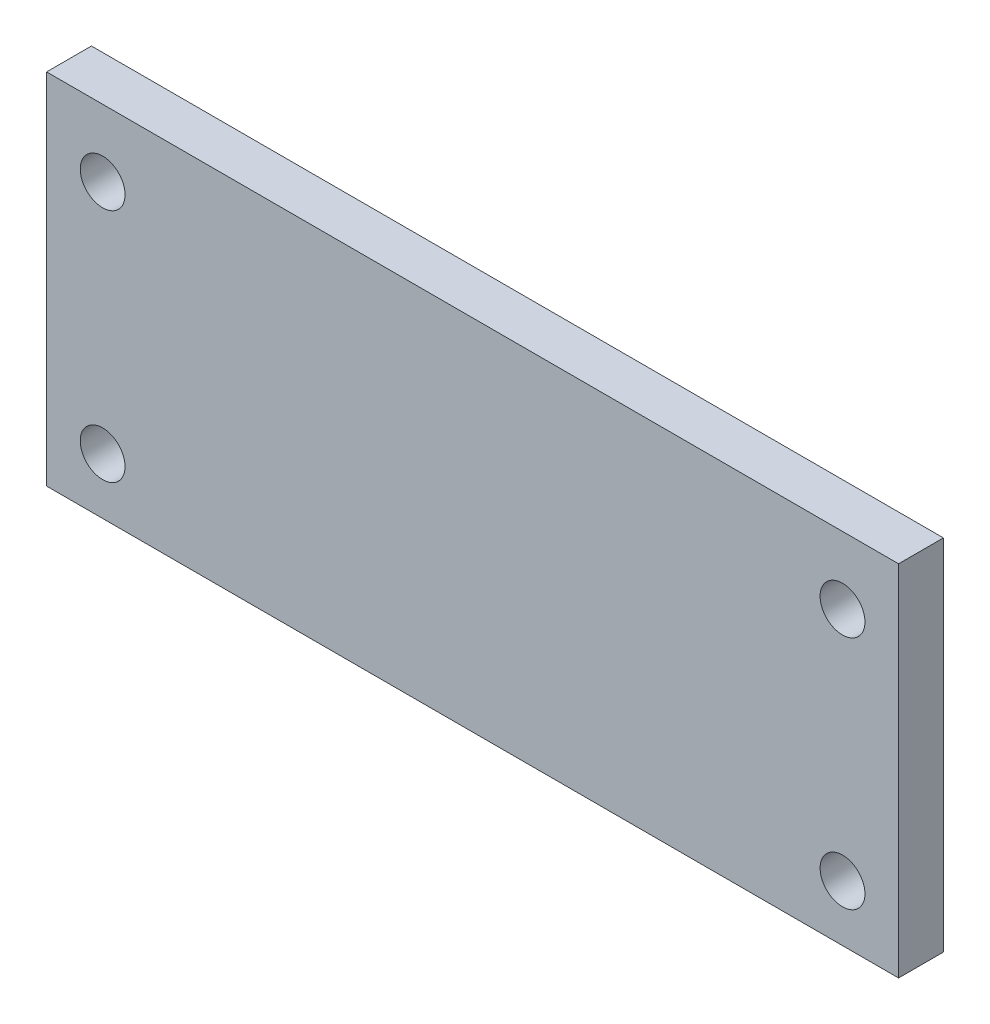
ISO-10303-21;
HEADER;
FILE_DESCRIPTION(('STEP AP214'),'2;1');
FILE_NAME('part.step','',(''),(''),'','','');
FILE_SCHEMA(('AUTOMOTIVE_DESIGN { 1 0 10303 214 1 1 1 1 }'));
ENDSEC;
DATA;
#1=APPLICATION_CONTEXT('core data for automotive mechanical design processes');
#2=APPLICATION_PROTOCOL_DEFINITION('international standard','automotive_design',2000,#1);
#3=PRODUCT_CONTEXT('',#1,'mechanical');
#4=PRODUCT('Part','Part','',(#3));
#5=PRODUCT_RELATED_PRODUCT_CATEGORY('part','',(#4));
#6=PRODUCT_DEFINITION_FORMATION('','',#4);
#7=PRODUCT_DEFINITION_CONTEXT('part definition',#1,'design');
#8=PRODUCT_DEFINITION('design','',#6,#7);
#9=PRODUCT_DEFINITION_SHAPE('','',#8);
#10=(LENGTH_UNIT() NAMED_UNIT(*) SI_UNIT(.MILLI.,.METRE.));
#11=(NAMED_UNIT(*) PLANE_ANGLE_UNIT() SI_UNIT($,.RADIAN.));
#12=(NAMED_UNIT(*) SI_UNIT($,.STERADIAN.) SOLID_ANGLE_UNIT());
#13=UNCERTAINTY_MEASURE_WITH_UNIT(LENGTH_MEASURE(1.E-05),#10,'distance_accuracy_value','');
#14=(GEOMETRIC_REPRESENTATION_CONTEXT(3) GLOBAL_UNCERTAINTY_ASSIGNED_CONTEXT((#13)) GLOBAL_UNIT_ASSIGNED_CONTEXT((#10,
#11,#12)) REPRESENTATION_CONTEXT('',''));
#15=CARTESIAN_POINT('',(0.,0.,0.));
#16=DIRECTION('',(0.,0.,1.));
#17=DIRECTION('',(1.,0.,0.));
#18=AXIS2_PLACEMENT_3D('',#15,#16,#17);
#19=CARTESIAN_POINT('',(0.,0.,4.));
#20=DIRECTION('',(0.,0.,-1.));
#21=DIRECTION('',(-1.,0.,0.));
#22=AXIS2_PLACEMENT_3D('',#19,#20,#21);
#23=PLANE('',#22);
#24=DIRECTION('',(0.,-1.,0.));
#25=VECTOR('',#24,1.);
#26=CARTESIAN_POINT('',(0.,0.,4.));
#27=LINE('',#26,#25);
#28=CARTESIAN_POINT('',(0.,32.,4.));
#29=VERTEX_POINT('',#28);
#30=CARTESIAN_POINT('',(0.,0.,4.));
#31=VERTEX_POINT('',#30);
#32=EDGE_CURVE('E89',#29,#31,#27,.T.);
#33=ORIENTED_EDGE('',*,*,#32,.T.);
#34=DIRECTION('',(1.,0.,0.));
#35=VECTOR('',#34,1.);
#36=CARTESIAN_POINT('',(0.,0.,4.));
#37=LINE('',#36,#35);
#38=CARTESIAN_POINT('',(76.,0.,4.));
#39=VERTEX_POINT('',#38);
#40=EDGE_CURVE('E84',#31,#39,#37,.T.);
#41=ORIENTED_EDGE('',*,*,#40,.T.);
#42=DIRECTION('',(0.,1.,0.));
#43=VECTOR('',#42,1.);
#44=CARTESIAN_POINT('',(76.,0.,4.));
#45=LINE('',#44,#43);
#46=CARTESIAN_POINT('',(76.,32.,4.));
#47=VERTEX_POINT('',#46);
#48=EDGE_CURVE('E87',#39,#47,#45,.T.);
#49=ORIENTED_EDGE('',*,*,#48,.T.);
#50=DIRECTION('',(-1.,0.,0.));
#51=VECTOR('',#50,1.);
#52=CARTESIAN_POINT('',(0.,32.,4.));
#53=LINE('',#52,#51);
#54=EDGE_CURVE('E54',#47,#29,#53,.T.);
#55=ORIENTED_EDGE('',*,*,#54,.T.);
#56=EDGE_LOOP('',(#33,#41,#49,#55));
#57=FACE_BOUND('',#56,.T.);
#58=CARTESIAN_POINT('',(5.,5.,4.));
#59=DIRECTION('',(0.,0.,1.));
#60=DIRECTION('',(1.,0.,0.));
#61=AXIS2_PLACEMENT_3D('',#58,#59,#60);
#62=CIRCLE('',#61,2.);
#63=CARTESIAN_POINT('',(7.,5.,4.));
#64=VERTEX_POINT('',#63);
#65=EDGE_CURVE('E104',#64,#64,#62,.T.);
#66=ORIENTED_EDGE('',*,*,#65,.F.);
#67=EDGE_LOOP('',(#66));
#68=FACE_BOUND('',#67,.T.);
#69=CARTESIAN_POINT('',(5.,26.,4.));
#70=DIRECTION('',(0.,0.,1.));
#71=DIRECTION('',(1.,0.,0.));
#72=AXIS2_PLACEMENT_3D('',#69,#70,#71);
#73=CIRCLE('',#72,2.);
#74=CARTESIAN_POINT('',(7.,26.,4.));
#75=VERTEX_POINT('',#74);
#76=EDGE_CURVE('E119',#75,#75,#73,.T.);
#77=ORIENTED_EDGE('',*,*,#76,.F.);
#78=EDGE_LOOP('',(#77));
#79=FACE_BOUND('',#78,.T.);
#80=CARTESIAN_POINT('',(71.,26.,4.));
#81=DIRECTION('',(0.,0.,1.));
#82=DIRECTION('',(1.,0.,0.));
#83=AXIS2_PLACEMENT_3D('',#80,#81,#82);
#84=CIRCLE('',#83,2.);
#85=CARTESIAN_POINT('',(73.,26.,4.));
#86=VERTEX_POINT('',#85);
#87=EDGE_CURVE('E125',#86,#86,#84,.T.);
#88=ORIENTED_EDGE('',*,*,#87,.F.);
#89=EDGE_LOOP('',(#88));
#90=FACE_BOUND('',#89,.T.);
#91=CARTESIAN_POINT('',(71.,5.,4.));
#92=DIRECTION('',(0.,0.,1.));
#93=DIRECTION('',(1.,0.,0.));
#94=AXIS2_PLACEMENT_3D('',#91,#92,#93);
#95=CIRCLE('',#94,2.);
#96=CARTESIAN_POINT('',(73.,5.,4.));
#97=VERTEX_POINT('',#96);
#98=EDGE_CURVE('E131',#97,#97,#95,.T.);
#99=ORIENTED_EDGE('',*,*,#98,.F.);
#100=EDGE_LOOP('',(#99));
#101=FACE_BOUND('',#100,.T.);
#102=ADVANCED_FACE('F37',(#57,#68,#79,#90,#101),#23,.F.);
#103=CARTESIAN_POINT('',(0.,0.,0.));
#104=DIRECTION('',(0.,0.,-1.));
#105=DIRECTION('',(-1.,0.,0.));
#106=AXIS2_PLACEMENT_3D('',#103,#104,#105);
#107=PLANE('',#106);
#108=CARTESIAN_POINT('',(71.,26.,0.));
#109=DIRECTION('',(0.,0.,1.));
#110=DIRECTION('',(1.,0.,0.));
#111=AXIS2_PLACEMENT_3D('',#108,#109,#110);
#112=CIRCLE('',#111,2.);
#113=CARTESIAN_POINT('',(73.,26.,0.));
#114=VERTEX_POINT('',#113);
#115=EDGE_CURVE('E128',#114,#114,#112,.T.);
#116=ORIENTED_EDGE('',*,*,#115,.T.);
#117=EDGE_LOOP('',(#116));
#118=FACE_BOUND('',#117,.T.);
#119=CARTESIAN_POINT('',(5.,5.,0.));
#120=DIRECTION('',(0.,0.,1.));
#121=DIRECTION('',(1.,0.,0.));
#122=AXIS2_PLACEMENT_3D('',#119,#120,#121);
#123=CIRCLE('',#122,2.);
#124=CARTESIAN_POINT('',(7.,5.,0.));
#125=VERTEX_POINT('',#124);
#126=EDGE_CURVE('E116',#125,#125,#123,.T.);
#127=ORIENTED_EDGE('',*,*,#126,.T.);
#128=EDGE_LOOP('',(#127));
#129=FACE_BOUND('',#128,.T.);
#130=DIRECTION('',(0.,-1.,0.));
#131=VECTOR('',#130,1.);
#132=CARTESIAN_POINT('',(0.,0.,0.));
#133=LINE('',#132,#131);
#134=CARTESIAN_POINT('',(0.,32.,0.));
#135=VERTEX_POINT('',#134);
#136=CARTESIAN_POINT('',(0.,0.,0.));
#137=VERTEX_POINT('',#136);
#138=EDGE_CURVE('E101',#135,#137,#133,.T.);
#139=ORIENTED_EDGE('',*,*,#138,.F.);
#140=DIRECTION('',(-1.,0.,0.));
#141=VECTOR('',#140,1.);
#142=CARTESIAN_POINT('',(0.,32.,0.));
#143=LINE('',#142,#141);
#144=CARTESIAN_POINT('',(76.,32.,0.));
#145=VERTEX_POINT('',#144);
#146=EDGE_CURVE('E77',#145,#135,#143,.T.);
#147=ORIENTED_EDGE('',*,*,#146,.F.);
#148=DIRECTION('',(0.,1.,0.));
#149=VECTOR('',#148,1.);
#150=CARTESIAN_POINT('',(76.,0.,0.));
#151=LINE('',#150,#149);
#152=CARTESIAN_POINT('',(76.,0.,0.));
#153=VERTEX_POINT('',#152);
#154=EDGE_CURVE('E71',#153,#145,#151,.T.);
#155=ORIENTED_EDGE('',*,*,#154,.F.);
#156=DIRECTION('',(1.,0.,0.));
#157=VECTOR('',#156,1.);
#158=CARTESIAN_POINT('',(0.,0.,0.));
#159=LINE('',#158,#157);
#160=EDGE_CURVE('E93',#137,#153,#159,.T.);
#161=ORIENTED_EDGE('',*,*,#160,.F.);
#162=EDGE_LOOP('',(#139,#147,#155,#161));
#163=FACE_BOUND('',#162,.T.);
#164=CARTESIAN_POINT('',(5.,26.,0.));
#165=DIRECTION('',(0.,0.,1.));
#166=DIRECTION('',(1.,0.,0.));
#167=AXIS2_PLACEMENT_3D('',#164,#165,#166);
#168=CIRCLE('',#167,2.);
#169=CARTESIAN_POINT('',(7.,26.,0.));
#170=VERTEX_POINT('',#169);
#171=EDGE_CURVE('E122',#170,#170,#168,.T.);
#172=ORIENTED_EDGE('',*,*,#171,.T.);
#173=EDGE_LOOP('',(#172));
#174=FACE_BOUND('',#173,.T.);
#175=CARTESIAN_POINT('',(71.,5.,0.));
#176=DIRECTION('',(0.,0.,1.));
#177=DIRECTION('',(1.,0.,0.));
#178=AXIS2_PLACEMENT_3D('',#175,#176,#177);
#179=CIRCLE('',#178,2.);
#180=CARTESIAN_POINT('',(73.,5.,0.));
#181=VERTEX_POINT('',#180);
#182=EDGE_CURVE('E134',#181,#181,#179,.T.);
#183=ORIENTED_EDGE('',*,*,#182,.T.);
#184=EDGE_LOOP('',(#183));
#185=FACE_BOUND('',#184,.T.);
#186=ADVANCED_FACE('F112',(#118,#129,#163,#174,#185),#107,.T.);
#187=CARTESIAN_POINT('',(0.,0.,4.));
#188=DIRECTION('',(1.,0.,0.));
#189=DIRECTION('',(0.,0.,-1.));
#190=AXIS2_PLACEMENT_3D('',#187,#188,#189);
#191=PLANE('',#190);
#192=ORIENTED_EDGE('',*,*,#138,.T.);
#193=DIRECTION('',(0.,0.,-1.));
#194=VECTOR('',#193,1.);
#195=CARTESIAN_POINT('',(0.,0.,4.));
#196=LINE('',#195,#194);
#197=EDGE_CURVE('E11',#31,#137,#196,.T.);
#198=ORIENTED_EDGE('',*,*,#197,.F.);
#199=ORIENTED_EDGE('',*,*,#32,.F.);
#200=DIRECTION('',(0.,0.,-1.));
#201=VECTOR('',#200,1.);
#202=CARTESIAN_POINT('',(0.,32.,4.));
#203=LINE('',#202,#201);
#204=EDGE_CURVE('E97',#29,#135,#203,.T.);
#205=ORIENTED_EDGE('',*,*,#204,.T.);
#206=EDGE_LOOP('',(#192,#198,#199,#205));
#207=FACE_BOUND('',#206,.T.);
#208=ADVANCED_FACE('F39',(#207),#191,.F.);
#209=CARTESIAN_POINT('',(0.,0.,4.));
#210=DIRECTION('',(0.,1.,0.));
#211=DIRECTION('',(0.,0.,1.));
#212=AXIS2_PLACEMENT_3D('',#209,#210,#211);
#213=PLANE('',#212);
#214=ORIENTED_EDGE('',*,*,#160,.T.);
#215=DIRECTION('',(0.,0.,-1.));
#216=VECTOR('',#215,1.);
#217=CARTESIAN_POINT('',(76.,0.,4.));
#218=LINE('',#217,#216);
#219=EDGE_CURVE('E46',#39,#153,#218,.T.);
#220=ORIENTED_EDGE('',*,*,#219,.F.);
#221=ORIENTED_EDGE('',*,*,#40,.F.);
#222=ORIENTED_EDGE('',*,*,#197,.T.);
#223=EDGE_LOOP('',(#214,#220,#221,#222));
#224=FACE_BOUND('',#223,.T.);
#225=ADVANCED_FACE('F92',(#224),#213,.F.);
#226=CARTESIAN_POINT('',(76.,0.,4.));
#227=DIRECTION('',(-1.,0.,0.));
#228=DIRECTION('',(0.,-1.,0.));
#229=AXIS2_PLACEMENT_3D('',#226,#227,#228);
#230=PLANE('',#229);
#231=ORIENTED_EDGE('',*,*,#154,.T.);
#232=DIRECTION('',(0.,0.,-1.));
#233=VECTOR('',#232,1.);
#234=CARTESIAN_POINT('',(76.,32.,4.));
#235=LINE('',#234,#233);
#236=EDGE_CURVE('E94',#47,#145,#235,.T.);
#237=ORIENTED_EDGE('',*,*,#236,.F.);
#238=ORIENTED_EDGE('',*,*,#48,.F.);
#239=ORIENTED_EDGE('',*,*,#219,.T.);
#240=EDGE_LOOP('',(#231,#237,#238,#239));
#241=FACE_BOUND('',#240,.T.);
#242=ADVANCED_FACE('F95',(#241),#230,.F.);
#243=CARTESIAN_POINT('',(0.,32.,4.));
#244=DIRECTION('',(0.,-1.,0.));
#245=DIRECTION('',(1.,0.,0.));
#246=AXIS2_PLACEMENT_3D('',#243,#244,#245);
#247=PLANE('',#246);
#248=ORIENTED_EDGE('',*,*,#146,.T.);
#249=ORIENTED_EDGE('',*,*,#204,.F.);
#250=ORIENTED_EDGE('',*,*,#54,.F.);
#251=ORIENTED_EDGE('',*,*,#236,.T.);
#252=EDGE_LOOP('',(#248,#249,#250,#251));
#253=FACE_BOUND('',#252,.T.);
#254=ADVANCED_FACE('F109',(#253),#247,.F.);
#255=CARTESIAN_POINT('',(5.,5.,4.));
#256=DIRECTION('',(0.,0.,-1.));
#257=DIRECTION('',(-1.,0.,0.));
#258=AXIS2_PLACEMENT_3D('',#255,#256,#257);
#259=CYLINDRICAL_SURFACE('',#258,2.);
#260=ORIENTED_EDGE('',*,*,#65,.T.);
#261=EDGE_LOOP('',(#260));
#262=FACE_BOUND('',#261,.T.);
#263=ORIENTED_EDGE('',*,*,#126,.F.);
#264=EDGE_LOOP('',(#263));
#265=FACE_BOUND('',#264,.T.);
#266=ADVANCED_FACE('F151',(#262,#265),#259,.F.);
#267=CARTESIAN_POINT('',(5.,26.,4.));
#268=DIRECTION('',(0.,0.,-1.));
#269=DIRECTION('',(-1.,0.,0.));
#270=AXIS2_PLACEMENT_3D('',#267,#268,#269);
#271=CYLINDRICAL_SURFACE('',#270,2.);
#272=ORIENTED_EDGE('',*,*,#76,.T.);
#273=EDGE_LOOP('',(#272));
#274=FACE_BOUND('',#273,.T.);
#275=ORIENTED_EDGE('',*,*,#171,.F.);
#276=EDGE_LOOP('',(#275));
#277=FACE_BOUND('',#276,.T.);
#278=ADVANCED_FACE('F197',(#274,#277),#271,.F.);
#279=CARTESIAN_POINT('',(71.,26.,4.));
#280=DIRECTION('',(0.,0.,-1.));
#281=DIRECTION('',(-1.,0.,0.));
#282=AXIS2_PLACEMENT_3D('',#279,#280,#281);
#283=CYLINDRICAL_SURFACE('',#282,2.);
#284=ORIENTED_EDGE('',*,*,#87,.T.);
#285=EDGE_LOOP('',(#284));
#286=FACE_BOUND('',#285,.T.);
#287=ORIENTED_EDGE('',*,*,#115,.F.);
#288=EDGE_LOOP('',(#287));
#289=FACE_BOUND('',#288,.T.);
#290=ADVANCED_FACE('F205',(#286,#289),#283,.F.);
#291=CARTESIAN_POINT('',(71.,5.,4.));
#292=DIRECTION('',(0.,0.,-1.));
#293=DIRECTION('',(-1.,0.,0.));
#294=AXIS2_PLACEMENT_3D('',#291,#292,#293);
#295=CYLINDRICAL_SURFACE('',#294,2.);
#296=ORIENTED_EDGE('',*,*,#98,.T.);
#297=EDGE_LOOP('',(#296));
#298=FACE_BOUND('',#297,.T.);
#299=ORIENTED_EDGE('',*,*,#182,.F.);
#300=EDGE_LOOP('',(#299));
#301=FACE_BOUND('',#300,.T.);
#302=ADVANCED_FACE('F140',(#298,#301),#295,.F.);
#303=CLOSED_SHELL('',(#102,#186,#208,#225,#242,#254,#266,#278,#290,#302));
#304=MANIFOLD_SOLID_BREP('B2',#303);
#305=ADVANCED_BREP_SHAPE_REPRESENTATION('',(#18,#304),#14);
#306=SHAPE_DEFINITION_REPRESENTATION(#9,#305);
ENDSEC;
END-ISO-10303-21;
